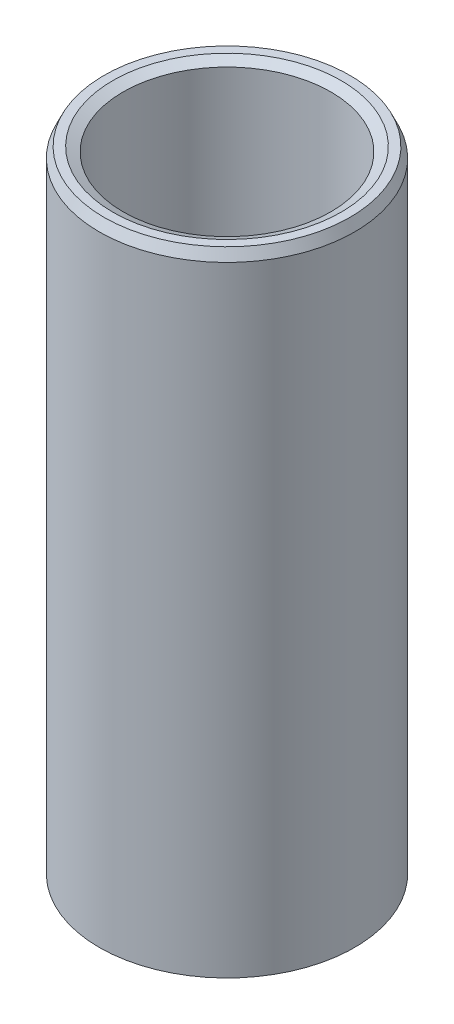
ISO-10303-21;
HEADER;
FILE_DESCRIPTION(('STEP AP214'),'2;1');
FILE_NAME('part.step','',(''),(''),'','','');
FILE_SCHEMA(('AUTOMOTIVE_DESIGN { 1 0 10303 214 1 1 1 1 }'));
ENDSEC;
DATA;
#1=APPLICATION_CONTEXT('core data for automotive mechanical design processes');
#2=APPLICATION_PROTOCOL_DEFINITION('international standard','automotive_design',2000,#1);
#3=PRODUCT_CONTEXT('',#1,'mechanical');
#4=PRODUCT('Part','Part','',(#3));
#5=PRODUCT_RELATED_PRODUCT_CATEGORY('part','',(#4));
#6=PRODUCT_DEFINITION_FORMATION('','',#4);
#7=PRODUCT_DEFINITION_CONTEXT('part definition',#1,'design');
#8=PRODUCT_DEFINITION('design','',#6,#7);
#9=PRODUCT_DEFINITION_SHAPE('','',#8);
#10=(LENGTH_UNIT() NAMED_UNIT(*) SI_UNIT(.MILLI.,.METRE.));
#11=(NAMED_UNIT(*) PLANE_ANGLE_UNIT() SI_UNIT($,.RADIAN.));
#12=(NAMED_UNIT(*) SI_UNIT($,.STERADIAN.) SOLID_ANGLE_UNIT());
#13=UNCERTAINTY_MEASURE_WITH_UNIT(LENGTH_MEASURE(1.E-05),#10,'distance_accuracy_value','');
#14=(GEOMETRIC_REPRESENTATION_CONTEXT(3) GLOBAL_UNCERTAINTY_ASSIGNED_CONTEXT((#13)) GLOBAL_UNIT_ASSIGNED_CONTEXT((#10,
#11,#12)) REPRESENTATION_CONTEXT('',''));
#15=CARTESIAN_POINT('',(0.,0.,0.));
#16=DIRECTION('',(0.,0.,1.));
#17=DIRECTION('',(1.,0.,0.));
#18=AXIS2_PLACEMENT_3D('',#15,#16,#17);
#19=CARTESIAN_POINT('',(0.,124.195019337366,0.));
#20=DIRECTION('',(0.,-1.,0.));
#21=DIRECTION('',(0.,0.,-1.));
#22=AXIS2_PLACEMENT_3D('',#19,#20,#21);
#23=CYLINDRICAL_SURFACE('',#22,25.);
#24=CARTESIAN_POINT('',(0.,0.932263151568483,0.));
#25=DIRECTION('',(0.,1.,0.));
#26=DIRECTION('',(0.,0.,1.));
#27=AXIS2_PLACEMENT_3D('',#24,#25,#26);
#28=CIRCLE('',#27,25.);
#29=CARTESIAN_POINT('',(0.,0.932263151568483,25.));
#30=VERTEX_POINT('',#29);
#31=EDGE_CURVE('E10',#30,#30,#28,.T.);
#32=ORIENTED_EDGE('',*,*,#31,.T.);
#33=EDGE_LOOP('',(#32));
#34=FACE_BOUND('',#33,.T.);
#35=CARTESIAN_POINT('',(0.,122.196169752864,0.));
#36=DIRECTION('',(0.,1.,0.));
#37=DIRECTION('',(0.,0.,1.));
#38=AXIS2_PLACEMENT_3D('',#35,#36,#37);
#39=CIRCLE('',#38,25.);
#40=CARTESIAN_POINT('',(0.,122.196169752864,25.));
#41=VERTEX_POINT('',#40);
#42=EDGE_CURVE('E50',#41,#41,#39,.F.);
#43=ORIENTED_EDGE('',*,*,#42,.T.);
#44=EDGE_LOOP('',(#43));
#45=FACE_BOUND('',#44,.T.);
#46=ADVANCED_FACE('F39',(#34,#45),#23,.T.);
#47=CARTESIAN_POINT('',(0.,124.195019337366,0.));
#48=DIRECTION('',(0.,1.,0.));
#49=DIRECTION('',(0.,0.,1.));
#50=AXIS2_PLACEMENT_3D('',#47,#48,#49);
#51=PLANE('',#50);
#52=CARTESIAN_POINT('',(0.,124.195019337366,0.));
#53=DIRECTION('',(0.,1.,0.));
#54=DIRECTION('',(0.,0.,1.));
#55=AXIS2_PLACEMENT_3D('',#52,#53,#54);
#56=CIRCLE('',#55,22.3308433440849);
#57=CARTESIAN_POINT('',(0.,124.195019337366,22.3308433440849));
#58=VERTEX_POINT('',#57);
#59=EDGE_CURVE('E58',#58,#58,#56,.F.);
#60=ORIENTED_EDGE('',*,*,#59,.T.);
#61=EDGE_LOOP('',(#60));
#62=FACE_BOUND('',#61,.T.);
#63=CARTESIAN_POINT('',(0.,124.195019337366,0.));
#64=DIRECTION('',(0.,1.,0.));
#65=DIRECTION('',(0.,0.,1.));
#66=AXIS2_PLACEMENT_3D('',#63,#64,#65);
#67=CIRCLE('',#66,24.0677368484315);
#68=CARTESIAN_POINT('',(0.,124.195019337366,24.0677368484315));
#69=VERTEX_POINT('',#68);
#70=EDGE_CURVE('E61',#69,#69,#67,.T.);
#71=ORIENTED_EDGE('',*,*,#70,.T.);
#72=EDGE_LOOP('',(#71));
#73=FACE_BOUND('',#72,.T.);
#74=ADVANCED_FACE('F88',(#62,#73),#51,.T.);
#75=CARTESIAN_POINT('',(0.,0.,0.));
#76=DIRECTION('',(0.,1.,0.));
#77=DIRECTION('',(0.,0.,1.));
#78=AXIS2_PLACEMENT_3D('',#75,#76,#77);
#79=PLANE('',#78);
#80=CARTESIAN_POINT('',(0.,0.,0.));
#81=DIRECTION('',(0.,1.,0.));
#82=DIRECTION('',(0.,0.,1.));
#83=AXIS2_PLACEMENT_3D('',#80,#81,#82);
#84=CIRCLE('',#83,21.2642569111512);
#85=CARTESIAN_POINT('',(0.,0.,21.2642569111512));
#86=VERTEX_POINT('',#85);
#87=EDGE_CURVE('E51',#86,#86,#84,.T.);
#88=ORIENTED_EDGE('',*,*,#87,.T.);
#89=EDGE_LOOP('',(#88));
#90=FACE_BOUND('',#89,.T.);
#91=CARTESIAN_POINT('',(0.,0.,0.));
#92=DIRECTION('',(0.,1.,0.));
#93=DIRECTION('',(0.,0.,1.));
#94=AXIS2_PLACEMENT_3D('',#91,#92,#93);
#95=CIRCLE('',#94,23.0011504154979);
#96=CARTESIAN_POINT('',(0.,0.,23.0011504154979));
#97=VERTEX_POINT('',#96);
#98=EDGE_CURVE('E54',#97,#97,#95,.F.);
#99=ORIENTED_EDGE('',*,*,#98,.T.);
#100=EDGE_LOOP('',(#99));
#101=FACE_BOUND('',#100,.T.);
#102=ADVANCED_FACE('F83',(#90,#101),#79,.F.);
#103=CARTESIAN_POINT('',(0.,124.195019337366,0.));
#104=DIRECTION('',(0.,-1.,0.));
#105=DIRECTION('',(0.,0.,-1.));
#106=AXIS2_PLACEMENT_3D('',#103,#104,#105);
#107=CYLINDRICAL_SURFACE('',#106,20.3319937595827);
#108=CARTESIAN_POINT('',(0.,123.262756185797,0.));
#109=DIRECTION('',(0.,1.,0.));
#110=DIRECTION('',(0.,0.,1.));
#111=AXIS2_PLACEMENT_3D('',#108,#109,#110);
#112=CIRCLE('',#111,20.3319937595827);
#113=CARTESIAN_POINT('',(0.,123.262756185797,20.3319937595827));
#114=VERTEX_POINT('',#113);
#115=EDGE_CURVE('E67',#114,#114,#112,.T.);
#116=ORIENTED_EDGE('',*,*,#115,.T.);
#117=EDGE_LOOP('',(#116));
#118=FACE_BOUND('',#117,.T.);
#119=CARTESIAN_POINT('',(0.,1.99884958450211,0.));
#120=DIRECTION('',(0.,1.,0.));
#121=DIRECTION('',(0.,0.,1.));
#122=AXIS2_PLACEMENT_3D('',#119,#120,#121);
#123=CIRCLE('',#122,20.3319937595827);
#124=CARTESIAN_POINT('',(0.,1.99884958450211,20.3319937595827));
#125=VERTEX_POINT('',#124);
#126=EDGE_CURVE('E69',#125,#125,#123,.F.);
#127=ORIENTED_EDGE('',*,*,#126,.T.);
#128=EDGE_LOOP('',(#127));
#129=FACE_BOUND('',#128,.T.);
#130=ADVANCED_FACE('F71',(#118,#129),#107,.F.);
#131=CARTESIAN_POINT('',(0.,123.262756185797,0.));
#132=DIRECTION('',(0.,1.,0.));
#133=DIRECTION('',(0.,0.,1.));
#134=AXIS2_PLACEMENT_3D('',#131,#132,#133);
#135=CONICAL_SURFACE('',#134,20.3319937595827,1.13438828852984);
#136=ORIENTED_EDGE('',*,*,#59,.F.);
#137=EDGE_LOOP('',(#136));
#138=FACE_BOUND('',#137,.T.);
#139=ORIENTED_EDGE('',*,*,#115,.F.);
#140=EDGE_LOOP('',(#139));
#141=FACE_BOUND('',#140,.T.);
#142=ADVANCED_FACE('F77',(#138,#141),#135,.F.);
#143=CARTESIAN_POINT('',(0.,0.,0.));
#144=DIRECTION('',(0.,-1.,0.));
#145=DIRECTION('',(0.,0.,-1.));
#146=AXIS2_PLACEMENT_3D('',#143,#144,#145);
#147=CONICAL_SURFACE('',#146,21.2642569111512,0.436408038265064);
#148=ORIENTED_EDGE('',*,*,#126,.F.);
#149=EDGE_LOOP('',(#148));
#150=FACE_BOUND('',#149,.T.);
#151=ORIENTED_EDGE('',*,*,#87,.F.);
#152=EDGE_LOOP('',(#151));
#153=FACE_BOUND('',#152,.T.);
#154=ADVANCED_FACE('F73',(#150,#153),#147,.F.);
#155=CARTESIAN_POINT('',(0.,0.932263151568483,0.));
#156=DIRECTION('',(0.,1.,0.));
#157=DIRECTION('',(0.,0.,1.));
#158=AXIS2_PLACEMENT_3D('',#155,#156,#157);
#159=CONICAL_SURFACE('',#158,25.,1.13438828852983);
#160=ORIENTED_EDGE('',*,*,#98,.F.);
#161=EDGE_LOOP('',(#160));
#162=FACE_BOUND('',#161,.T.);
#163=ORIENTED_EDGE('',*,*,#31,.F.);
#164=EDGE_LOOP('',(#163));
#165=FACE_BOUND('',#164,.T.);
#166=ADVANCED_FACE('F76',(#162,#165),#159,.T.);
#167=CARTESIAN_POINT('',(0.,124.195019337366,0.));
#168=DIRECTION('',(0.,-1.,0.));
#169=DIRECTION('',(0.,0.,-1.));
#170=AXIS2_PLACEMENT_3D('',#167,#168,#169);
#171=CONICAL_SURFACE('',#170,24.0677368484315,0.436408038265066);
#172=ORIENTED_EDGE('',*,*,#42,.F.);
#173=EDGE_LOOP('',(#172));
#174=FACE_BOUND('',#173,.T.);
#175=ORIENTED_EDGE('',*,*,#70,.F.);
#176=EDGE_LOOP('',(#175));
#177=FACE_BOUND('',#176,.T.);
#178=ADVANCED_FACE('F45',(#174,#177),#171,.T.);
#179=CLOSED_SHELL('',(#46,#74,#102,#130,#142,#154,#166,#178));
#180=MANIFOLD_SOLID_BREP('B2',#179);
#181=ADVANCED_BREP_SHAPE_REPRESENTATION('',(#18,#180),#14);
#182=SHAPE_DEFINITION_REPRESENTATION(#9,#181);
ENDSEC;
END-ISO-10303-21;
